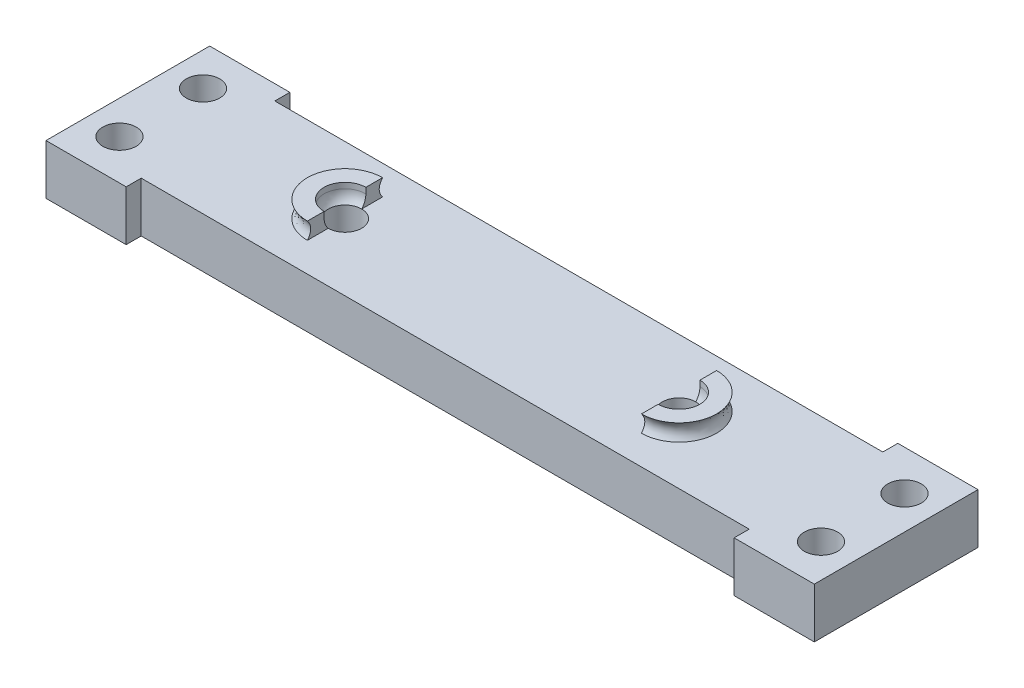
ISO-10303-21;
HEADER;
FILE_DESCRIPTION(('STEP AP214'),'2;1');
FILE_NAME('part.step','',(''),(''),'','','');
FILE_SCHEMA(('AUTOMOTIVE_DESIGN { 1 0 10303 214 1 1 1 1 }'));
ENDSEC;
DATA;
#1=APPLICATION_CONTEXT('core data for automotive mechanical design processes');
#2=APPLICATION_PROTOCOL_DEFINITION('international standard','automotive_design',2000,#1);
#3=PRODUCT_CONTEXT('',#1,'mechanical');
#4=PRODUCT('Part','Part','',(#3));
#5=PRODUCT_RELATED_PRODUCT_CATEGORY('part','',(#4));
#6=PRODUCT_DEFINITION_FORMATION('','',#4);
#7=PRODUCT_DEFINITION_CONTEXT('part definition',#1,'design');
#8=PRODUCT_DEFINITION('design','',#6,#7);
#9=PRODUCT_DEFINITION_SHAPE('','',#8);
#10=(LENGTH_UNIT() NAMED_UNIT(*) SI_UNIT(.MILLI.,.METRE.));
#11=(NAMED_UNIT(*) PLANE_ANGLE_UNIT() SI_UNIT($,.RADIAN.));
#12=(NAMED_UNIT(*) SI_UNIT($,.STERADIAN.) SOLID_ANGLE_UNIT());
#13=UNCERTAINTY_MEASURE_WITH_UNIT(LENGTH_MEASURE(1.E-05),#10,'distance_accuracy_value','');
#14=(GEOMETRIC_REPRESENTATION_CONTEXT(3) GLOBAL_UNCERTAINTY_ASSIGNED_CONTEXT((#13)) GLOBAL_UNIT_ASSIGNED_CONTEXT((#10,
#11,#12)) REPRESENTATION_CONTEXT('',''));
#15=CARTESIAN_POINT('',(0.,0.,0.));
#16=DIRECTION('',(0.,0.,1.));
#17=DIRECTION('',(1.,0.,0.));
#18=AXIS2_PLACEMENT_3D('',#15,#16,#17);
#19=CARTESIAN_POINT('',(3.00570826429431,5.,1.75));
#20=DIRECTION('',(1.,0.,0.));
#21=DIRECTION('',(0.,0.,-1.));
#22=AXIS2_PLACEMENT_3D('',#19,#20,#21);
#23=PLANE('',#22);
#24=CARTESIAN_POINT('',(3.00570826429431,4.,1.75));
#25=CARTESIAN_POINT('',(3.00570826429431,4.5,2.15));
#26=CARTESIAN_POINT('',(3.00570826429431,5.,1.75));
#27=B_SPLINE_CURVE_WITH_KNOTS('',2,(#24,#25,#26),.UNSPECIFIED.,.F.,.F.,(3,3),(0.,1.),.UNSPECIFIED.);
#28=CARTESIAN_POINT('',(3.00570826429431,4.,1.75));
#29=VERTEX_POINT('',#28);
#30=CARTESIAN_POINT('',(3.00570826429431,5.,1.75));
#31=VERTEX_POINT('',#30);
#32=EDGE_CURVE('E314',#29,#31,#27,.T.);
#33=ORIENTED_EDGE('',*,*,#32,.F.);
#34=DIRECTION('',(0.,0.,1.));
#35=VECTOR('',#34,1.);
#36=CARTESIAN_POINT('',(3.00570826429431,4.,1.75));
#37=LINE('',#36,#35);
#38=CARTESIAN_POINT('',(3.00570826429431,4.,3.00000000000001));
#39=VERTEX_POINT('',#38);
#40=EDGE_CURVE('E49',#29,#39,#37,.T.);
#41=ORIENTED_EDGE('',*,*,#40,.T.);
#42=CARTESIAN_POINT('',(3.00570826429431,4.66143782776615,3.75));
#43=DIRECTION('',(1.,0.,0.));
#44=DIRECTION('',(0.,0.,-1.));
#45=AXIS2_PLACEMENT_3D('',#42,#43,#44);
#46=CIRCLE('',#45,1.);
#47=CARTESIAN_POINT('',(3.00570826429431,4.66143782776615,2.75));
#48=VERTEX_POINT('',#47);
#49=EDGE_CURVE('E11',#39,#48,#46,.T.);
#50=ORIENTED_EDGE('',*,*,#49,.T.);
#51=DIRECTION('',(0.,-1.,0.));
#52=VECTOR('',#51,1.);
#53=CARTESIAN_POINT('',(3.00570826429431,5.,2.75));
#54=LINE('',#53,#52);
#55=CARTESIAN_POINT('',(3.00570826429431,5.,2.75));
#56=VERTEX_POINT('',#55);
#57=EDGE_CURVE('E353',#56,#48,#54,.T.);
#58=ORIENTED_EDGE('',*,*,#57,.F.);
#59=DIRECTION('',(0.,0.,1.));
#60=VECTOR('',#59,1.);
#61=CARTESIAN_POINT('',(3.00570826429431,5.,1.75));
#62=LINE('',#61,#60);
#63=EDGE_CURVE('E340',#31,#56,#62,.T.);
#64=ORIENTED_EDGE('',*,*,#63,.F.);
#65=EDGE_LOOP('',(#33,#41,#50,#58,#64));
#66=FACE_BOUND('',#65,.T.);
#67=ADVANCED_FACE('F35',(#66),#23,.F.);
#68=CARTESIAN_POINT('',(3.00570826429431,5.,5.25));
#69=DIRECTION('',(1.,0.,0.));
#70=DIRECTION('',(0.,0.,-1.));
#71=AXIS2_PLACEMENT_3D('',#68,#69,#70);
#72=PLANE('',#71);
#73=CARTESIAN_POINT('',(3.00570826429431,4.,6.25000000000001));
#74=CARTESIAN_POINT('',(3.00570826429431,4.5,5.85000000000001));
#75=CARTESIAN_POINT('',(3.00570826429431,5.,6.25000000000001));
#76=B_SPLINE_CURVE_WITH_KNOTS('',2,(#73,#74,#75),.UNSPECIFIED.,.F.,.F.,(3,3),(0.,1.),.UNSPECIFIED.);
#77=CARTESIAN_POINT('',(3.00570826429431,5.,6.25000000000001));
#78=VERTEX_POINT('',#77);
#79=CARTESIAN_POINT('',(3.00570826429431,4.,6.25000000000001));
#80=VERTEX_POINT('',#79);
#81=EDGE_CURVE('E284',#78,#80,#76,.F.);
#82=ORIENTED_EDGE('',*,*,#81,.F.);
#83=DIRECTION('',(0.,0.,1.));
#84=VECTOR('',#83,1.);
#85=CARTESIAN_POINT('',(3.00570826429431,5.,5.25));
#86=LINE('',#85,#84);
#87=CARTESIAN_POINT('',(3.00570826429431,5.,5.25000000000001));
#88=VERTEX_POINT('',#87);
#89=EDGE_CURVE('E344',#88,#78,#86,.T.);
#90=ORIENTED_EDGE('',*,*,#89,.F.);
#91=DIRECTION('',(0.,-1.,0.));
#92=VECTOR('',#91,1.);
#93=CARTESIAN_POINT('',(3.00570826429431,5.,5.25000000000001));
#94=LINE('',#93,#92);
#95=CARTESIAN_POINT('',(3.00570826429431,4.66143782776615,5.25000000000001));
#96=VERTEX_POINT('',#95);
#97=EDGE_CURVE('E347',#88,#96,#94,.T.);
#98=ORIENTED_EDGE('',*,*,#97,.T.);
#99=CARTESIAN_POINT('',(3.00570826429431,4.66143782776615,4.25000000000001));
#100=DIRECTION('',(1.,0.,0.));
#101=DIRECTION('',(0.,0.,-1.));
#102=AXIS2_PLACEMENT_3D('',#99,#100,#101);
#103=CIRCLE('',#102,1.);
#104=CARTESIAN_POINT('',(3.00570826429431,4.,5.00000000000001));
#105=VERTEX_POINT('',#104);
#106=EDGE_CURVE('E43',#96,#105,#103,.T.);
#107=ORIENTED_EDGE('',*,*,#106,.T.);
#108=DIRECTION('',(0.,0.,1.));
#109=VECTOR('',#108,1.);
#110=CARTESIAN_POINT('',(3.00570826429431,4.,5.25));
#111=LINE('',#110,#109);
#112=EDGE_CURVE('E56',#105,#80,#111,.T.);
#113=ORIENTED_EDGE('',*,*,#112,.T.);
#114=EDGE_LOOP('',(#82,#90,#98,#107,#113));
#115=FACE_BOUND('',#114,.T.);
#116=ADVANCED_FACE('F422',(#115),#72,.F.);
#117=CARTESIAN_POINT('',(0.,4.,0.));
#118=DIRECTION('',(0.,1.,0.));
#119=DIRECTION('',(0.,0.,1.));
#120=AXIS2_PLACEMENT_3D('',#117,#118,#119);
#121=PLANE('',#120);
#122=DIRECTION('',(0.,0.,-1.));
#123=VECTOR('',#122,1.);
#124=CARTESIAN_POINT('',(-16.9942917357057,4.,1.75000000000001));
#125=LINE('',#124,#123);
#126=CARTESIAN_POINT('',(-16.9942917357057,4.,3.));
#127=VERTEX_POINT('',#126);
#128=CARTESIAN_POINT('',(-16.9942917357057,4.,1.75000000000001));
#129=VERTEX_POINT('',#128);
#130=EDGE_CURVE('E361',#127,#129,#125,.T.);
#131=ORIENTED_EDGE('',*,*,#130,.F.);
#132=CARTESIAN_POINT('',(-16.9942917357057,4.,4.00000000000001));
#133=DIRECTION('',(0.,1.,0.));
#134=DIRECTION('',(0.,0.,1.));
#135=AXIS2_PLACEMENT_3D('',#132,#133,#134);
#136=CIRCLE('',#135,1.);
#137=CARTESIAN_POINT('',(-16.9942917357057,4.,5.00000000000001));
#138=VERTEX_POINT('',#137);
#139=EDGE_CURVE('E246',#138,#127,#136,.T.);
#140=ORIENTED_EDGE('',*,*,#139,.F.);
#141=DIRECTION('',(0.,0.,-1.));
#142=VECTOR('',#141,1.);
#143=CARTESIAN_POINT('',(-16.9942917357057,4.,6.25000000000001));
#144=LINE('',#143,#142);
#145=CARTESIAN_POINT('',(-16.9942917357057,4.,6.25000000000001));
#146=VERTEX_POINT('',#145);
#147=EDGE_CURVE('E370',#146,#138,#144,.T.);
#148=ORIENTED_EDGE('',*,*,#147,.F.);
#149=CARTESIAN_POINT('',(-16.9942917357057,4.,4.00000000000001));
#150=DIRECTION('',(0.,1.,0.));
#151=DIRECTION('',(0.,0.,1.));
#152=AXIS2_PLACEMENT_3D('',#149,#150,#151);
#153=CIRCLE('',#152,2.25);
#154=EDGE_CURVE('E356',#129,#146,#153,.T.);
#155=ORIENTED_EDGE('',*,*,#154,.F.);
#156=EDGE_LOOP('',(#131,#140,#148,#155));
#157=FACE_BOUND('',#156,.T.);
#158=ORIENTED_EDGE('',*,*,#112,.F.);
#159=CARTESIAN_POINT('',(3.00570826429431,4.,4.00000000000001));
#160=DIRECTION('',(0.,1.,0.));
#161=DIRECTION('',(0.,0.,1.));
#162=AXIS2_PLACEMENT_3D('',#159,#160,#161);
#163=CIRCLE('',#162,1.);
#164=EDGE_CURVE('E249',#39,#105,#163,.T.);
#165=ORIENTED_EDGE('',*,*,#164,.F.);
#166=ORIENTED_EDGE('',*,*,#40,.F.);
#167=CARTESIAN_POINT('',(3.00570826429431,4.,4.00000000000001));
#168=DIRECTION('',(0.,1.,0.));
#169=DIRECTION('',(0.,0.,-1.));
#170=AXIS2_PLACEMENT_3D('',#167,#168,#169);
#171=CIRCLE('',#170,2.25);
#172=EDGE_CURVE('E333',#80,#29,#171,.T.);
#173=ORIENTED_EDGE('',*,*,#172,.F.);
#174=EDGE_LOOP('',(#158,#165,#166,#173));
#175=FACE_BOUND('',#174,.T.);
#176=DIRECTION('',(1.,0.,0.));
#177=VECTOR('',#176,1.);
#178=CARTESIAN_POINT('',(0.,4.,-0.899999999999998));
#179=LINE('',#178,#177);
#180=CARTESIAN_POINT('',(-29.9942917357057,4.,-0.900000000000001));
#181=VERTEX_POINT('',#180);
#182=CARTESIAN_POINT('',(-25.1942917357057,4.,-0.900000000000001));
#183=VERTEX_POINT('',#182);
#184=EDGE_CURVE('E194',#181,#183,#179,.T.);
#185=ORIENTED_EDGE('',*,*,#184,.F.);
#186=DIRECTION('',(0.,0.,1.));
#187=VECTOR('',#186,1.);
#188=CARTESIAN_POINT('',(-29.9942917357057,4.,-0.999999999999999));
#189=LINE('',#188,#187);
#190=CARTESIAN_POINT('',(-29.9942917357057,4.,8.90000000000001));
#191=VERTEX_POINT('',#190);
#192=EDGE_CURVE('E191',#181,#191,#189,.T.);
#193=ORIENTED_EDGE('',*,*,#192,.T.);
#194=DIRECTION('',(-1.,0.,0.));
#195=VECTOR('',#194,1.);
#196=CARTESIAN_POINT('',(0.,4.,8.90000000000001));
#197=LINE('',#196,#195);
#198=CARTESIAN_POINT('',(-25.1942917357057,4.,8.90000000000001));
#199=VERTEX_POINT('',#198);
#200=EDGE_CURVE('E255',#199,#191,#197,.T.);
#201=ORIENTED_EDGE('',*,*,#200,.F.);
#202=DIRECTION('',(0.,0.,1.));
#203=VECTOR('',#202,1.);
#204=CARTESIAN_POINT('',(-25.1942917357057,4.,0.));
#205=LINE('',#204,#203);
#206=CARTESIAN_POINT('',(-25.1942917357057,4.,8.00000000000001));
#207=VERTEX_POINT('',#206);
#208=EDGE_CURVE('E281',#207,#199,#205,.T.);
#209=ORIENTED_EDGE('',*,*,#208,.F.);
#210=DIRECTION('',(1.,0.,0.));
#211=VECTOR('',#210,1.);
#212=CARTESIAN_POINT('',(11.0057082642943,4.,8.));
#213=LINE('',#212,#211);
#214=CARTESIAN_POINT('',(11.2057082642943,4.,8.));
#215=VERTEX_POINT('',#214);
#216=EDGE_CURVE('E392',#207,#215,#213,.T.);
#217=ORIENTED_EDGE('',*,*,#216,.T.);
#218=DIRECTION('',(0.,0.,-1.));
#219=VECTOR('',#218,1.);
#220=CARTESIAN_POINT('',(11.2057082642943,4.,0.));
#221=LINE('',#220,#219);
#222=CARTESIAN_POINT('',(11.2057082642943,4.,8.9));
#223=VERTEX_POINT('',#222);
#224=EDGE_CURVE('E273',#223,#215,#221,.T.);
#225=ORIENTED_EDGE('',*,*,#224,.F.);
#226=DIRECTION('',(-1.,0.,0.));
#227=VECTOR('',#226,1.);
#228=CARTESIAN_POINT('',(0.,4.,8.9));
#229=LINE('',#228,#227);
#230=CARTESIAN_POINT('',(16.0057082642943,4.,8.9));
#231=VERTEX_POINT('',#230);
#232=EDGE_CURVE('E264',#231,#223,#229,.T.);
#233=ORIENTED_EDGE('',*,*,#232,.F.);
#234=DIRECTION('',(0.,0.,-1.));
#235=VECTOR('',#234,1.);
#236=CARTESIAN_POINT('',(16.0057082642943,4.,9.));
#237=LINE('',#236,#235);
#238=CARTESIAN_POINT('',(16.0057082642943,4.,-0.900000000000004));
#239=VERTEX_POINT('',#238);
#240=EDGE_CURVE('E395',#231,#239,#237,.T.);
#241=ORIENTED_EDGE('',*,*,#240,.T.);
#242=DIRECTION('',(1.,0.,0.));
#243=VECTOR('',#242,1.);
#244=CARTESIAN_POINT('',(0.,4.,-0.900000000000004));
#245=LINE('',#244,#243);
#246=CARTESIAN_POINT('',(11.2057082642943,4.,-0.900000000000004));
#247=VERTEX_POINT('',#246);
#248=EDGE_CURVE('E260',#247,#239,#245,.T.);
#249=ORIENTED_EDGE('',*,*,#248,.F.);
#250=DIRECTION('',(0.,0.,-1.));
#251=VECTOR('',#250,1.);
#252=CARTESIAN_POINT('',(11.2057082642943,4.,0.));
#253=LINE('',#252,#251);
#254=CARTESIAN_POINT('',(11.2057082642943,4.,0.));
#255=VERTEX_POINT('',#254);
#256=EDGE_CURVE('E268',#255,#247,#253,.T.);
#257=ORIENTED_EDGE('',*,*,#256,.F.);
#258=DIRECTION('',(-1.,0.,0.));
#259=VECTOR('',#258,1.);
#260=CARTESIAN_POINT('',(-24.9942917357057,4.,0.));
#261=LINE('',#260,#259);
#262=CARTESIAN_POINT('',(-25.1942917357057,4.,0.));
#263=VERTEX_POINT('',#262);
#264=EDGE_CURVE('E398',#255,#263,#261,.T.);
#265=ORIENTED_EDGE('',*,*,#264,.T.);
#266=DIRECTION('',(0.,0.,1.));
#267=VECTOR('',#266,1.);
#268=CARTESIAN_POINT('',(-25.1942917357057,4.,0.));
#269=LINE('',#268,#267);
#270=EDGE_CURVE('E277',#183,#263,#269,.T.);
#271=ORIENTED_EDGE('',*,*,#270,.F.);
#272=EDGE_LOOP('',(#185,#193,#201,#209,#217,#225,#233,#241,#249,#257,#265,#271));
#273=FACE_BOUND('',#272,.T.);
#274=CARTESIAN_POINT('',(14.0057082642943,4.,6.5));
#275=DIRECTION('',(0.,1.,0.));
#276=DIRECTION('',(0.,0.,1.));
#277=AXIS2_PLACEMENT_3D('',#274,#275,#276);
#278=CIRCLE('',#277,1.);
#279=CARTESIAN_POINT('',(14.0057082642943,4.,7.50000000000001));
#280=VERTEX_POINT('',#279);
#281=EDGE_CURVE('E379',#280,#280,#278,.T.);
#282=ORIENTED_EDGE('',*,*,#281,.F.);
#283=EDGE_LOOP('',(#282));
#284=FACE_BOUND('',#283,.T.);
#285=CARTESIAN_POINT('',(-27.9942917357057,4.,1.5));
#286=DIRECTION('',(0.,1.,0.));
#287=DIRECTION('',(0.,0.,1.));
#288=AXIS2_PLACEMENT_3D('',#285,#286,#287);
#289=CIRCLE('',#288,1.);
#290=CARTESIAN_POINT('',(-27.9942917357057,4.,2.5));
#291=VERTEX_POINT('',#290);
#292=EDGE_CURVE('E385',#291,#291,#289,.T.);
#293=ORIENTED_EDGE('',*,*,#292,.F.);
#294=EDGE_LOOP('',(#293));
#295=FACE_BOUND('',#294,.T.);
#296=CARTESIAN_POINT('',(-27.9942917357057,4.,6.5));
#297=DIRECTION('',(0.,1.,0.));
#298=DIRECTION('',(0.,0.,1.));
#299=AXIS2_PLACEMENT_3D('',#296,#297,#298);
#300=CIRCLE('',#299,1.);
#301=CARTESIAN_POINT('',(-27.9942917357057,4.,7.50000000000001));
#302=VERTEX_POINT('',#301);
#303=EDGE_CURVE('E388',#302,#302,#300,.T.);
#304=ORIENTED_EDGE('',*,*,#303,.F.);
#305=EDGE_LOOP('',(#304));
#306=FACE_BOUND('',#305,.T.);
#307=CARTESIAN_POINT('',(14.0057082642943,4.,1.5));
#308=DIRECTION('',(0.,1.,0.));
#309=DIRECTION('',(0.,0.,1.));
#310=AXIS2_PLACEMENT_3D('',#307,#308,#309);
#311=CIRCLE('',#310,1.);
#312=CARTESIAN_POINT('',(14.0057082642943,4.,2.5));
#313=VERTEX_POINT('',#312);
#314=EDGE_CURVE('E382',#313,#313,#311,.T.);
#315=ORIENTED_EDGE('',*,*,#314,.F.);
#316=EDGE_LOOP('',(#315));
#317=FACE_BOUND('',#316,.T.);
#318=ADVANCED_FACE('F438',(#157,#175,#273,#284,#295,#306,#317),#121,.T.);
#319=CARTESIAN_POINT('',(-29.9942917357057,4.,-0.999999999999999));
#320=DIRECTION('',(1.,0.,0.));
#321=DIRECTION('',(0.,0.,-1.));
#322=AXIS2_PLACEMENT_3D('',#319,#320,#321);
#323=PLANE('',#322);
#324=ORIENTED_EDGE('',*,*,#192,.F.);
#325=DIRECTION('',(0.,-1.,0.));
#326=VECTOR('',#325,1.);
#327=CARTESIAN_POINT('',(-29.9942917357057,7.,-0.900000000000001));
#328=LINE('',#327,#326);
#329=CARTESIAN_POINT('',(-29.9942917357057,1.,-0.900000000000001));
#330=VERTEX_POINT('',#329);
#331=EDGE_CURVE('E185',#181,#330,#328,.T.);
#332=ORIENTED_EDGE('',*,*,#331,.T.);
#333=DIRECTION('',(0.,0.,-1.));
#334=VECTOR('',#333,1.);
#335=CARTESIAN_POINT('',(-29.9942917357057,1.,-0.900000000000001));
#336=LINE('',#335,#334);
#337=CARTESIAN_POINT('',(-29.9942917357057,1.,8.90000000000001));
#338=VERTEX_POINT('',#337);
#339=EDGE_CURVE('E190',#338,#330,#336,.T.);
#340=ORIENTED_EDGE('',*,*,#339,.F.);
#341=DIRECTION('',(0.,-1.,0.));
#342=VECTOR('',#341,1.);
#343=CARTESIAN_POINT('',(-29.9942917357057,7.,8.90000000000001));
#344=LINE('',#343,#342);
#345=EDGE_CURVE('E253',#191,#338,#344,.T.);
#346=ORIENTED_EDGE('',*,*,#345,.F.);
#347=EDGE_LOOP('',(#324,#332,#340,#346));
#348=FACE_BOUND('',#347,.T.);
#349=ADVANCED_FACE('F187',(#348),#323,.F.);
#350=CARTESIAN_POINT('',(11.0057082642943,4.,8.));
#351=DIRECTION('',(0.,0.,-1.));
#352=DIRECTION('',(-1.,0.,0.));
#353=AXIS2_PLACEMENT_3D('',#350,#351,#352);
#354=PLANE('',#353);
#355=DIRECTION('',(0.,-1.,0.));
#356=VECTOR('',#355,1.);
#357=CARTESIAN_POINT('',(-25.1942917357057,7.,8.00000000000001));
#358=LINE('',#357,#356);
#359=CARTESIAN_POINT('',(-25.1942917357057,1.,8.00000000000001));
#360=VERTEX_POINT('',#359);
#361=EDGE_CURVE('E279',#207,#360,#358,.T.);
#362=ORIENTED_EDGE('',*,*,#361,.T.);
#363=DIRECTION('',(-1.,0.,0.));
#364=VECTOR('',#363,1.);
#365=CARTESIAN_POINT('',(-25.1942917357057,1.,8.00000000000001));
#366=LINE('',#365,#364);
#367=CARTESIAN_POINT('',(11.2057082642943,1.,8.));
#368=VERTEX_POINT('',#367);
#369=EDGE_CURVE('E239',#368,#360,#366,.T.);
#370=ORIENTED_EDGE('',*,*,#369,.F.);
#371=DIRECTION('',(0.,-1.,0.));
#372=VECTOR('',#371,1.);
#373=CARTESIAN_POINT('',(11.2057082642943,7.,8.));
#374=LINE('',#373,#372);
#375=EDGE_CURVE('E271',#215,#368,#374,.T.);
#376=ORIENTED_EDGE('',*,*,#375,.F.);
#377=ORIENTED_EDGE('',*,*,#216,.F.);
#378=EDGE_LOOP('',(#362,#370,#376,#377));
#379=FACE_BOUND('',#378,.T.);
#380=ADVANCED_FACE('F533',(#379),#354,.F.);
#381=CARTESIAN_POINT('',(16.0057082642943,4.,9.));
#382=DIRECTION('',(-1.,0.,0.));
#383=DIRECTION('',(0.,0.,1.));
#384=AXIS2_PLACEMENT_3D('',#381,#382,#383);
#385=PLANE('',#384);
#386=DIRECTION('',(0.,-1.,0.));
#387=VECTOR('',#386,1.);
#388=CARTESIAN_POINT('',(16.0057082642943,7.,8.9));
#389=LINE('',#388,#387);
#390=CARTESIAN_POINT('',(16.0057082642943,1.,8.9));
#391=VERTEX_POINT('',#390);
#392=EDGE_CURVE('E262',#231,#391,#389,.T.);
#393=ORIENTED_EDGE('',*,*,#392,.T.);
#394=DIRECTION('',(0.,0.,1.));
#395=VECTOR('',#394,1.);
#396=CARTESIAN_POINT('',(16.0057082642943,1.,8.9));
#397=LINE('',#396,#395);
#398=CARTESIAN_POINT('',(16.0057082642943,1.,-0.900000000000004));
#399=VERTEX_POINT('',#398);
#400=EDGE_CURVE('E230',#399,#391,#397,.T.);
#401=ORIENTED_EDGE('',*,*,#400,.F.);
#402=DIRECTION('',(0.,-1.,0.));
#403=VECTOR('',#402,1.);
#404=CARTESIAN_POINT('',(16.0057082642943,7.,-0.900000000000004));
#405=LINE('',#404,#403);
#406=EDGE_CURVE('E258',#239,#399,#405,.T.);
#407=ORIENTED_EDGE('',*,*,#406,.F.);
#408=ORIENTED_EDGE('',*,*,#240,.F.);
#409=EDGE_LOOP('',(#393,#401,#407,#408));
#410=FACE_BOUND('',#409,.T.);
#411=ADVANCED_FACE('F529',(#410),#385,.F.);
#412=CARTESIAN_POINT('',(-24.9942917357057,4.,0.));
#413=DIRECTION('',(0.,0.,1.));
#414=DIRECTION('',(1.,0.,0.));
#415=AXIS2_PLACEMENT_3D('',#412,#413,#414);
#416=PLANE('',#415);
#417=DIRECTION('',(0.,-1.,0.));
#418=VECTOR('',#417,1.);
#419=CARTESIAN_POINT('',(11.2057082642943,7.,0.));
#420=LINE('',#419,#418);
#421=CARTESIAN_POINT('',(11.2057082642943,1.,0.));
#422=VERTEX_POINT('',#421);
#423=EDGE_CURVE('E266',#255,#422,#420,.T.);
#424=ORIENTED_EDGE('',*,*,#423,.T.);
#425=DIRECTION('',(1.,0.,0.));
#426=VECTOR('',#425,1.);
#427=CARTESIAN_POINT('',(11.2057082642943,1.,0.));
#428=LINE('',#427,#426);
#429=CARTESIAN_POINT('',(-25.1942917357057,1.,0.));
#430=VERTEX_POINT('',#429);
#431=EDGE_CURVE('E221',#430,#422,#428,.T.);
#432=ORIENTED_EDGE('',*,*,#431,.F.);
#433=DIRECTION('',(0.,-1.,0.));
#434=VECTOR('',#433,1.);
#435=CARTESIAN_POINT('',(-25.1942917357057,7.,0.));
#436=LINE('',#435,#434);
#437=EDGE_CURVE('E275',#263,#430,#436,.T.);
#438=ORIENTED_EDGE('',*,*,#437,.F.);
#439=ORIENTED_EDGE('',*,*,#264,.F.);
#440=EDGE_LOOP('',(#424,#432,#438,#439));
#441=FACE_BOUND('',#440,.T.);
#442=ADVANCED_FACE('F524',(#441),#416,.F.);
#443=CARTESIAN_POINT('',(-27.9942917357057,4.,6.5));
#444=DIRECTION('',(0.,-1.,0.));
#445=DIRECTION('',(0.,0.,-1.));
#446=AXIS2_PLACEMENT_3D('',#443,#444,#445);
#447=CYLINDRICAL_SURFACE('',#446,1.);
#448=ORIENTED_EDGE('',*,*,#303,.T.);
#449=EDGE_LOOP('',(#448));
#450=FACE_BOUND('',#449,.T.);
#451=CARTESIAN_POINT('',(-27.9942917357057,1.,6.5));
#452=DIRECTION('',(0.,-1.,0.));
#453=DIRECTION('',(0.,0.,-1.));
#454=AXIS2_PLACEMENT_3D('',#451,#452,#453);
#455=CIRCLE('',#454,1.);
#456=CARTESIAN_POINT('',(-27.9942917357057,1.,5.5));
#457=VERTEX_POINT('',#456);
#458=EDGE_CURVE('E213',#457,#457,#455,.T.);
#459=ORIENTED_EDGE('',*,*,#458,.T.);
#460=EDGE_LOOP('',(#459));
#461=FACE_BOUND('',#460,.T.);
#462=ADVANCED_FACE('F521',(#450,#461),#447,.F.);
#463=CARTESIAN_POINT('',(-27.9942917357057,4.,1.5));
#464=DIRECTION('',(0.,-1.,0.));
#465=DIRECTION('',(0.,0.,-1.));
#466=AXIS2_PLACEMENT_3D('',#463,#464,#465);
#467=CYLINDRICAL_SURFACE('',#466,1.);
#468=ORIENTED_EDGE('',*,*,#292,.T.);
#469=EDGE_LOOP('',(#468));
#470=FACE_BOUND('',#469,.T.);
#471=CARTESIAN_POINT('',(-27.9942917357057,1.,1.5));
#472=DIRECTION('',(0.,-1.,0.));
#473=DIRECTION('',(0.,0.,-1.));
#474=AXIS2_PLACEMENT_3D('',#471,#472,#473);
#475=CIRCLE('',#474,1.);
#476=CARTESIAN_POINT('',(-27.9942917357057,1.,0.500000000000002));
#477=VERTEX_POINT('',#476);
#478=EDGE_CURVE('E216',#477,#477,#475,.T.);
#479=ORIENTED_EDGE('',*,*,#478,.T.);
#480=EDGE_LOOP('',(#479));
#481=FACE_BOUND('',#480,.T.);
#482=ADVANCED_FACE('F457',(#470,#481),#467,.F.);
#483=CARTESIAN_POINT('',(14.0057082642943,4.,1.5));
#484=DIRECTION('',(0.,-1.,0.));
#485=DIRECTION('',(0.,0.,-1.));
#486=AXIS2_PLACEMENT_3D('',#483,#484,#485);
#487=CYLINDRICAL_SURFACE('',#486,1.);
#488=ORIENTED_EDGE('',*,*,#314,.T.);
#489=EDGE_LOOP('',(#488));
#490=FACE_BOUND('',#489,.T.);
#491=CARTESIAN_POINT('',(14.0057082642943,1.,1.5));
#492=DIRECTION('',(0.,-1.,0.));
#493=DIRECTION('',(0.,0.,-1.));
#494=AXIS2_PLACEMENT_3D('',#491,#492,#493);
#495=CIRCLE('',#494,1.);
#496=CARTESIAN_POINT('',(14.0057082642943,1.,0.500000000000002));
#497=VERTEX_POINT('',#496);
#498=EDGE_CURVE('E461',#497,#497,#495,.T.);
#499=ORIENTED_EDGE('',*,*,#498,.T.);
#500=EDGE_LOOP('',(#499));
#501=FACE_BOUND('',#500,.T.);
#502=ADVANCED_FACE('F453',(#490,#501),#487,.F.);
#503=CARTESIAN_POINT('',(14.0057082642943,4.,6.5));
#504=DIRECTION('',(0.,-1.,0.));
#505=DIRECTION('',(0.,0.,-1.));
#506=AXIS2_PLACEMENT_3D('',#503,#504,#505);
#507=CYLINDRICAL_SURFACE('',#506,1.);
#508=ORIENTED_EDGE('',*,*,#281,.T.);
#509=EDGE_LOOP('',(#508));
#510=FACE_BOUND('',#509,.T.);
#511=CARTESIAN_POINT('',(14.0057082642943,1.,6.5));
#512=DIRECTION('',(0.,-1.,0.));
#513=DIRECTION('',(0.,0.,-1.));
#514=AXIS2_PLACEMENT_3D('',#511,#512,#513);
#515=CIRCLE('',#514,1.);
#516=CARTESIAN_POINT('',(14.0057082642943,1.,5.5));
#517=VERTEX_POINT('',#516);
#518=EDGE_CURVE('E463',#517,#517,#515,.T.);
#519=ORIENTED_EDGE('',*,*,#518,.T.);
#520=EDGE_LOOP('',(#519));
#521=FACE_BOUND('',#520,.T.);
#522=ADVANCED_FACE('F456',(#510,#521),#507,.F.);
#523=CARTESIAN_POINT('',(-16.9942917357057,5.,6.25000000000001));
#524=DIRECTION('',(-1.,0.,0.));
#525=DIRECTION('',(0.,0.,1.));
#526=AXIS2_PLACEMENT_3D('',#523,#524,#525);
#527=PLANE('',#526);
#528=DIRECTION('',(0.,0.,-1.));
#529=VECTOR('',#528,1.);
#530=CARTESIAN_POINT('',(-16.9942917357057,5.,6.25000000000001));
#531=LINE('',#530,#529);
#532=CARTESIAN_POINT('',(-16.9942917357057,5.,6.25000000000001));
#533=VERTEX_POINT('',#532);
#534=CARTESIAN_POINT('',(-16.9942917357057,5.,5.25000000000001));
#535=VERTEX_POINT('',#534);
#536=EDGE_CURVE('E360',#533,#535,#531,.T.);
#537=ORIENTED_EDGE('',*,*,#536,.F.);
#538=CARTESIAN_POINT('',(-16.9942917357057,5.,6.25));
#539=CARTESIAN_POINT('',(-16.9942917357057,4.5,5.85));
#540=CARTESIAN_POINT('',(-16.9942917357057,4.,6.25));
#541=B_SPLINE_CURVE_WITH_KNOTS('',2,(#538,#539,#540),.UNSPECIFIED.,.F.,.F.,(3,3),(0.,1.),.UNSPECIFIED.);
#542=EDGE_CURVE('E325',#533,#146,#541,.T.);
#543=ORIENTED_EDGE('',*,*,#542,.T.);
#544=ORIENTED_EDGE('',*,*,#147,.T.);
#545=CARTESIAN_POINT('',(-16.9942917357057,4.66143782776615,4.25000000000001));
#546=DIRECTION('',(-1.,0.,0.));
#547=DIRECTION('',(0.,0.,1.));
#548=AXIS2_PLACEMENT_3D('',#545,#546,#547);
#549=CIRCLE('',#548,1.);
#550=CARTESIAN_POINT('',(-16.9942917357057,4.66143782776615,5.25000000000001));
#551=VERTEX_POINT('',#550);
#552=EDGE_CURVE('E415',#138,#551,#549,.T.);
#553=ORIENTED_EDGE('',*,*,#552,.T.);
#554=DIRECTION('',(0.,-1.,0.));
#555=VECTOR('',#554,1.);
#556=CARTESIAN_POINT('',(-16.9942917357057,5.,5.25000000000001));
#557=LINE('',#556,#555);
#558=EDGE_CURVE('E376',#535,#551,#557,.T.);
#559=ORIENTED_EDGE('',*,*,#558,.F.);
#560=EDGE_LOOP('',(#537,#543,#544,#553,#559));
#561=FACE_BOUND('',#560,.T.);
#562=ADVANCED_FACE('F511',(#561),#527,.F.);
#563=CARTESIAN_POINT('',(-16.9942917357057,5.,4.00000000000001));
#564=DIRECTION('',(0.,-1.,0.));
#565=DIRECTION('',(0.,0.,-1.));
#566=AXIS2_PLACEMENT_3D('',#563,#564,#565);
#567=CYLINDRICAL_SURFACE('',#566,1.25);
#568=ORIENTED_EDGE('',*,*,#558,.T.);
#569=CARTESIAN_POINT('',(-16.9942917357057,4.66143782776615,4.00000000000001));
#570=DIRECTION('',(0.,-1.,0.));
#571=DIRECTION('',(0.,0.,-1.));
#572=AXIS2_PLACEMENT_3D('',#569,#570,#571);
#573=CIRCLE('',#572,1.25);
#574=CARTESIAN_POINT('',(-16.9942917357057,4.66143782776615,2.75));
#575=VERTEX_POINT('',#574);
#576=EDGE_CURVE('E409',#551,#575,#573,.T.);
#577=ORIENTED_EDGE('',*,*,#576,.T.);
#578=DIRECTION('',(0.,-1.,0.));
#579=VECTOR('',#578,1.);
#580=CARTESIAN_POINT('',(-16.9942917357057,5.,2.75));
#581=LINE('',#580,#579);
#582=CARTESIAN_POINT('',(-16.9942917357057,5.,2.75));
#583=VERTEX_POINT('',#582);
#584=EDGE_CURVE('E368',#583,#575,#581,.T.);
#585=ORIENTED_EDGE('',*,*,#584,.F.);
#586=CARTESIAN_POINT('',(-16.9942917357057,5.,4.00000000000001));
#587=DIRECTION('',(0.,-1.,0.));
#588=DIRECTION('',(0.,0.,1.));
#589=AXIS2_PLACEMENT_3D('',#586,#587,#588);
#590=CIRCLE('',#589,1.25);
#591=EDGE_CURVE('E363',#535,#583,#590,.T.);
#592=ORIENTED_EDGE('',*,*,#591,.F.);
#593=EDGE_LOOP('',(#568,#577,#585,#592));
#594=FACE_BOUND('',#593,.T.);
#595=ADVANCED_FACE('F507',(#594),#567,.F.);
#596=CARTESIAN_POINT('',(-16.9942917357057,5.,1.75000000000001));
#597=DIRECTION('',(-1.,0.,0.));
#598=DIRECTION('',(0.,0.,1.));
#599=AXIS2_PLACEMENT_3D('',#596,#597,#598);
#600=PLANE('',#599);
#601=ORIENTED_EDGE('',*,*,#130,.T.);
#602=CARTESIAN_POINT('',(-16.9942917357057,5.,1.75000000000001));
#603=CARTESIAN_POINT('',(-16.9942917357057,4.5,2.15));
#604=CARTESIAN_POINT('',(-16.9942917357057,4.,1.75000000000001));
#605=B_SPLINE_CURVE_WITH_KNOTS('',2,(#602,#603,#604),.UNSPECIFIED.,.F.,.F.,(3,3),(0.,1.),.UNSPECIFIED.);
#606=CARTESIAN_POINT('',(-16.9942917357057,5.,1.75000000000001));
#607=VERTEX_POINT('',#606);
#608=EDGE_CURVE('E317',#129,#607,#605,.F.);
#609=ORIENTED_EDGE('',*,*,#608,.T.);
#610=DIRECTION('',(0.,0.,-1.));
#611=VECTOR('',#610,1.);
#612=CARTESIAN_POINT('',(-16.9942917357057,5.,1.75000000000001));
#613=LINE('',#612,#611);
#614=EDGE_CURVE('E365',#583,#607,#613,.T.);
#615=ORIENTED_EDGE('',*,*,#614,.F.);
#616=ORIENTED_EDGE('',*,*,#584,.T.);
#617=CARTESIAN_POINT('',(-16.9942917357057,4.66143782776615,3.75));
#618=DIRECTION('',(-1.,0.,0.));
#619=DIRECTION('',(0.,0.,1.));
#620=AXIS2_PLACEMENT_3D('',#617,#618,#619);
#621=CIRCLE('',#620,1.);
#622=EDGE_CURVE('E412',#575,#127,#621,.T.);
#623=ORIENTED_EDGE('',*,*,#622,.T.);
#624=EDGE_LOOP('',(#601,#609,#615,#616,#623));
#625=FACE_BOUND('',#624,.T.);
#626=ADVANCED_FACE('F503',(#625),#600,.F.);
#627=CARTESIAN_POINT('',(-16.9942917357057,5.,4.00000000000001));
#628=DIRECTION('',(0.,1.,0.));
#629=DIRECTION('',(0.,0.,1.));
#630=AXIS2_PLACEMENT_3D('',#627,#628,#629);
#631=PLANE('',#630);
#632=CARTESIAN_POINT('',(-16.9942917357057,5.,4.00000000000001));
#633=DIRECTION('',(0.,1.,0.));
#634=DIRECTION('',(0.,0.,1.));
#635=AXIS2_PLACEMENT_3D('',#632,#633,#634);
#636=CIRCLE('',#635,2.25);
#637=EDGE_CURVE('E357',#607,#533,#636,.T.);
#638=ORIENTED_EDGE('',*,*,#637,.T.);
#639=ORIENTED_EDGE('',*,*,#536,.T.);
#640=ORIENTED_EDGE('',*,*,#591,.T.);
#641=ORIENTED_EDGE('',*,*,#614,.T.);
#642=EDGE_LOOP('',(#638,#639,#640,#641));
#643=FACE_BOUND('',#642,.T.);
#644=ADVANCED_FACE('F500',(#643),#631,.T.);
#645=CARTESIAN_POINT('',(3.00570826429431,5.,4.00000000000001));
#646=DIRECTION('',(0.,-1.,0.));
#647=DIRECTION('',(0.,0.,-1.));
#648=AXIS2_PLACEMENT_3D('',#645,#646,#647);
#649=CYLINDRICAL_SURFACE('',#648,1.25);
#650=ORIENTED_EDGE('',*,*,#57,.T.);
#651=CARTESIAN_POINT('',(3.00570826429431,4.66143782776615,4.00000000000001));
#652=DIRECTION('',(0.,-1.,0.));
#653=DIRECTION('',(0.,0.,-1.));
#654=AXIS2_PLACEMENT_3D('',#651,#652,#653);
#655=CIRCLE('',#654,1.25);
#656=EDGE_CURVE('E417',#48,#96,#655,.T.);
#657=ORIENTED_EDGE('',*,*,#656,.T.);
#658=ORIENTED_EDGE('',*,*,#97,.F.);
#659=CARTESIAN_POINT('',(3.00570826429431,5.,4.00000000000001));
#660=DIRECTION('',(0.,-1.,0.));
#661=DIRECTION('',(0.,0.,-1.));
#662=AXIS2_PLACEMENT_3D('',#659,#660,#661);
#663=CIRCLE('',#662,1.25);
#664=EDGE_CURVE('E342',#56,#88,#663,.T.);
#665=ORIENTED_EDGE('',*,*,#664,.F.);
#666=EDGE_LOOP('',(#650,#657,#658,#665));
#667=FACE_BOUND('',#666,.T.);
#668=ADVANCED_FACE('F436',(#667),#649,.F.);
#669=CARTESIAN_POINT('',(3.00570826429431,5.,4.00000000000001));
#670=DIRECTION('',(0.,-1.,0.));
#671=DIRECTION('',(0.,0.,-1.));
#672=AXIS2_PLACEMENT_3D('',#669,#670,#671);
#673=PLANE('',#672);
#674=CARTESIAN_POINT('',(3.00570826429431,5.,4.00000000000001));
#675=DIRECTION('',(0.,1.,0.));
#676=DIRECTION('',(0.,0.,-1.));
#677=AXIS2_PLACEMENT_3D('',#674,#675,#676);
#678=CIRCLE('',#677,2.25);
#679=EDGE_CURVE('E334',#78,#31,#678,.T.);
#680=ORIENTED_EDGE('',*,*,#679,.T.);
#681=ORIENTED_EDGE('',*,*,#63,.T.);
#682=ORIENTED_EDGE('',*,*,#664,.T.);
#683=ORIENTED_EDGE('',*,*,#89,.T.);
#684=EDGE_LOOP('',(#680,#681,#682,#683));
#685=FACE_BOUND('',#684,.T.);
#686=ADVANCED_FACE('F307',(#685),#673,.F.);
#687=CARTESIAN_POINT('',(-16.9942917357057,5.,1.75000000000001));
#688=CARTESIAN_POINT('',(-16.9942917357057,4.5,2.15));
#689=CARTESIAN_POINT('',(-16.9942917357057,4.,1.75000000000001));
#690=B_SPLINE_CURVE_WITH_KNOTS('',2,(#687,#688,#689),.UNSPECIFIED.,.F.,.F.,(3,3),(0.,1.),.UNSPECIFIED.);
#691=CARTESIAN_POINT('',(-16.9942917357057,5.,4.00000000000001));
#692=DIRECTION('',(0.,-1.,0.));
#693=AXIS1_PLACEMENT('',#691,#692);
#694=SURFACE_OF_REVOLUTION('',#690,#693);
#695=ORIENTED_EDGE('',*,*,#637,.F.);
#696=ORIENTED_EDGE('',*,*,#608,.F.);
#697=ORIENTED_EDGE('',*,*,#154,.T.);
#698=ORIENTED_EDGE('',*,*,#542,.F.);
#699=EDGE_LOOP('',(#695,#696,#697,#698));
#700=FACE_BOUND('',#699,.T.);
#701=ADVANCED_FACE('F301',(#700),#694,.T.);
#702=CARTESIAN_POINT('',(3.00570826429431,4.,1.75));
#703=CARTESIAN_POINT('',(3.00570826429431,4.5,2.15));
#704=CARTESIAN_POINT('',(3.00570826429431,5.,1.75));
#705=B_SPLINE_CURVE_WITH_KNOTS('',2,(#702,#703,#704),.UNSPECIFIED.,.F.,.F.,(3,3),(0.,1.),.UNSPECIFIED.);
#706=CARTESIAN_POINT('',(3.00570826429431,5.,4.00000000000001));
#707=DIRECTION('',(0.,-1.,0.));
#708=AXIS1_PLACEMENT('',#706,#707);
#709=SURFACE_OF_REVOLUTION('',#705,#708);
#710=ORIENTED_EDGE('',*,*,#32,.T.);
#711=ORIENTED_EDGE('',*,*,#679,.F.);
#712=ORIENTED_EDGE('',*,*,#81,.T.);
#713=ORIENTED_EDGE('',*,*,#172,.T.);
#714=EDGE_LOOP('',(#710,#711,#712,#713));
#715=FACE_BOUND('',#714,.T.);
#716=ADVANCED_FACE('F296',(#715),#709,.F.);
#717=CARTESIAN_POINT('',(-25.1942917357057,7.,8.00000000000001));
#718=DIRECTION('',(-1.,0.,0.));
#719=DIRECTION('',(0.,0.,1.));
#720=AXIS2_PLACEMENT_3D('',#717,#718,#719);
#721=PLANE('',#720);
#722=ORIENTED_EDGE('',*,*,#208,.T.);
#723=DIRECTION('',(0.,-1.,0.));
#724=VECTOR('',#723,1.);
#725=CARTESIAN_POINT('',(-25.1942917357057,7.,8.90000000000001));
#726=LINE('',#725,#724);
#727=CARTESIAN_POINT('',(-25.1942917357057,1.,8.90000000000001));
#728=VERTEX_POINT('',#727);
#729=EDGE_CURVE('E406',#199,#728,#726,.T.);
#730=ORIENTED_EDGE('',*,*,#729,.T.);
#731=DIRECTION('',(0.,0.,1.));
#732=VECTOR('',#731,1.);
#733=CARTESIAN_POINT('',(-25.1942917357057,1.,8.90000000000001));
#734=LINE('',#733,#732);
#735=EDGE_CURVE('E242',#360,#728,#734,.T.);
#736=ORIENTED_EDGE('',*,*,#735,.F.);
#737=ORIENTED_EDGE('',*,*,#361,.F.);
#738=EDGE_LOOP('',(#722,#730,#736,#737));
#739=FACE_BOUND('',#738,.T.);
#740=ADVANCED_FACE('F300',(#739),#721,.F.);
#741=CARTESIAN_POINT('',(-25.1942917357057,7.,0.));
#742=DIRECTION('',(-1.,0.,0.));
#743=DIRECTION('',(0.,0.,1.));
#744=AXIS2_PLACEMENT_3D('',#741,#742,#743);
#745=PLANE('',#744);
#746=ORIENTED_EDGE('',*,*,#437,.T.);
#747=DIRECTION('',(0.,0.,1.));
#748=VECTOR('',#747,1.);
#749=CARTESIAN_POINT('',(-25.1942917357057,1.,0.));
#750=LINE('',#749,#748);
#751=CARTESIAN_POINT('',(-25.1942917357057,1.,-0.900000000000001));
#752=VERTEX_POINT('',#751);
#753=EDGE_CURVE('E205',#752,#430,#750,.T.);
#754=ORIENTED_EDGE('',*,*,#753,.F.);
#755=DIRECTION('',(0.,1.,0.));
#756=VECTOR('',#755,1.);
#757=CARTESIAN_POINT('',(-25.1942917357057,7.,-0.900000000000001));
#758=LINE('',#757,#756);
#759=EDGE_CURVE('E201',#752,#183,#758,.T.);
#760=ORIENTED_EDGE('',*,*,#759,.T.);
#761=ORIENTED_EDGE('',*,*,#270,.T.);
#762=EDGE_LOOP('',(#746,#754,#760,#761));
#763=FACE_BOUND('',#762,.T.);
#764=ADVANCED_FACE('F642',(#763),#745,.F.);
#765=CARTESIAN_POINT('',(11.2057082642943,7.,9.));
#766=DIRECTION('',(1.,0.,0.));
#767=DIRECTION('',(0.,0.,-1.));
#768=AXIS2_PLACEMENT_3D('',#765,#766,#767);
#769=PLANE('',#768);
#770=ORIENTED_EDGE('',*,*,#375,.T.);
#771=DIRECTION('',(0.,0.,-1.));
#772=VECTOR('',#771,1.);
#773=CARTESIAN_POINT('',(11.2057082642943,1.,8.));
#774=LINE('',#773,#772);
#775=CARTESIAN_POINT('',(11.2057082642943,1.,8.9));
#776=VERTEX_POINT('',#775);
#777=EDGE_CURVE('E236',#776,#368,#774,.T.);
#778=ORIENTED_EDGE('',*,*,#777,.F.);
#779=DIRECTION('',(0.,1.,0.));
#780=VECTOR('',#779,1.);
#781=CARTESIAN_POINT('',(11.2057082642943,7.,8.9));
#782=LINE('',#781,#780);
#783=EDGE_CURVE('E401',#776,#223,#782,.T.);
#784=ORIENTED_EDGE('',*,*,#783,.T.);
#785=ORIENTED_EDGE('',*,*,#224,.T.);
#786=EDGE_LOOP('',(#770,#778,#784,#785));
#787=FACE_BOUND('',#786,.T.);
#788=ADVANCED_FACE('F631',(#787),#769,.F.);
#789=CARTESIAN_POINT('',(11.2057082642943,7.,-1.));
#790=DIRECTION('',(1.,0.,0.));
#791=DIRECTION('',(0.,0.,-1.));
#792=AXIS2_PLACEMENT_3D('',#789,#790,#791);
#793=PLANE('',#792);
#794=ORIENTED_EDGE('',*,*,#256,.T.);
#795=DIRECTION('',(0.,-1.,0.));
#796=VECTOR('',#795,1.);
#797=CARTESIAN_POINT('',(11.2057082642943,7.,-0.900000000000004));
#798=LINE('',#797,#796);
#799=CARTESIAN_POINT('',(11.2057082642943,1.,-0.900000000000004));
#800=VERTEX_POINT('',#799);
#801=EDGE_CURVE('E404',#247,#800,#798,.T.);
#802=ORIENTED_EDGE('',*,*,#801,.T.);
#803=DIRECTION('',(0.,0.,-1.));
#804=VECTOR('',#803,1.);
#805=CARTESIAN_POINT('',(11.2057082642943,1.,-0.900000000000004));
#806=LINE('',#805,#804);
#807=EDGE_CURVE('E224',#422,#800,#806,.T.);
#808=ORIENTED_EDGE('',*,*,#807,.F.);
#809=ORIENTED_EDGE('',*,*,#423,.F.);
#810=EDGE_LOOP('',(#794,#802,#808,#809));
#811=FACE_BOUND('',#810,.T.);
#812=ADVANCED_FACE('F620',(#811),#793,.F.);
#813=CARTESIAN_POINT('',(16.0057082642943,7.,8.9));
#814=DIRECTION('',(0.,0.,-1.));
#815=DIRECTION('',(-1.,0.,0.));
#816=AXIS2_PLACEMENT_3D('',#813,#814,#815);
#817=PLANE('',#816);
#818=ORIENTED_EDGE('',*,*,#232,.T.);
#819=ORIENTED_EDGE('',*,*,#783,.F.);
#820=DIRECTION('',(-1.,0.,0.));
#821=VECTOR('',#820,1.);
#822=CARTESIAN_POINT('',(11.2057082642943,1.,8.9));
#823=LINE('',#822,#821);
#824=EDGE_CURVE('E233',#391,#776,#823,.T.);
#825=ORIENTED_EDGE('',*,*,#824,.F.);
#826=ORIENTED_EDGE('',*,*,#392,.F.);
#827=EDGE_LOOP('',(#818,#819,#825,#826));
#828=FACE_BOUND('',#827,.T.);
#829=ADVANCED_FACE('F609',(#828),#817,.F.);
#830=CARTESIAN_POINT('',(11.2057082642943,7.,-0.900000000000004));
#831=DIRECTION('',(0.,0.,1.));
#832=DIRECTION('',(1.,0.,0.));
#833=AXIS2_PLACEMENT_3D('',#830,#831,#832);
#834=PLANE('',#833);
#835=ORIENTED_EDGE('',*,*,#248,.T.);
#836=ORIENTED_EDGE('',*,*,#406,.T.);
#837=DIRECTION('',(1.,0.,0.));
#838=VECTOR('',#837,1.);
#839=CARTESIAN_POINT('',(16.0057082642943,1.,-0.900000000000004));
#840=LINE('',#839,#838);
#841=EDGE_CURVE('E227',#800,#399,#840,.T.);
#842=ORIENTED_EDGE('',*,*,#841,.F.);
#843=ORIENTED_EDGE('',*,*,#801,.F.);
#844=EDGE_LOOP('',(#835,#836,#842,#843));
#845=FACE_BOUND('',#844,.T.);
#846=ADVANCED_FACE('F598',(#845),#834,.F.);
#847=CARTESIAN_POINT('',(-29.9942917357057,7.,8.90000000000001));
#848=DIRECTION('',(0.,0.,-1.));
#849=DIRECTION('',(-1.,0.,0.));
#850=AXIS2_PLACEMENT_3D('',#847,#848,#849);
#851=PLANE('',#850);
#852=ORIENTED_EDGE('',*,*,#200,.T.);
#853=ORIENTED_EDGE('',*,*,#345,.T.);
#854=DIRECTION('',(-1.,0.,0.));
#855=VECTOR('',#854,1.);
#856=CARTESIAN_POINT('',(-29.9942917357057,1.,8.90000000000001));
#857=LINE('',#856,#855);
#858=EDGE_CURVE('E212',#728,#338,#857,.T.);
#859=ORIENTED_EDGE('',*,*,#858,.F.);
#860=ORIENTED_EDGE('',*,*,#729,.F.);
#861=EDGE_LOOP('',(#852,#853,#859,#860));
#862=FACE_BOUND('',#861,.T.);
#863=ADVANCED_FACE('F491',(#862),#851,.F.);
#864=CARTESIAN_POINT('',(-25.1942917357057,7.,-0.900000000000001));
#865=DIRECTION('',(0.,0.,1.));
#866=DIRECTION('',(1.,0.,0.));
#867=AXIS2_PLACEMENT_3D('',#864,#865,#866);
#868=PLANE('',#867);
#869=ORIENTED_EDGE('',*,*,#184,.T.);
#870=ORIENTED_EDGE('',*,*,#759,.F.);
#871=DIRECTION('',(1.,0.,0.));
#872=VECTOR('',#871,1.);
#873=CARTESIAN_POINT('',(-25.1942917357057,1.,-0.900000000000001));
#874=LINE('',#873,#872);
#875=EDGE_CURVE('E198',#330,#752,#874,.T.);
#876=ORIENTED_EDGE('',*,*,#875,.F.);
#877=ORIENTED_EDGE('',*,*,#331,.F.);
#878=EDGE_LOOP('',(#869,#870,#876,#877));
#879=FACE_BOUND('',#878,.T.);
#880=ADVANCED_FACE('F199',(#879),#868,.F.);
#881=CARTESIAN_POINT('',(3.00570826429431,0.,4.00000000000001));
#882=DIRECTION('',(0.,1.,0.));
#883=DIRECTION('',(0.,0.,1.));
#884=AXIS2_PLACEMENT_3D('',#881,#882,#883);
#885=CYLINDRICAL_SURFACE('',#884,1.);
#886=EDGE_CURVE('E195',#105,#39,#163,.T.);
#887=ORIENTED_EDGE('',*,*,#886,.T.);
#888=ORIENTED_EDGE('',*,*,#164,.T.);
#889=EDGE_LOOP('',(#887,#888));
#890=FACE_BOUND('',#889,.T.);
#891=CARTESIAN_POINT('',(3.00570826429431,1.,4.00000000000001));
#892=DIRECTION('',(0.,-1.,0.));
#893=DIRECTION('',(0.,0.,-1.));
#894=AXIS2_PLACEMENT_3D('',#891,#892,#893);
#895=CIRCLE('',#894,1.);
#896=CARTESIAN_POINT('',(3.00570826429431,1.,3.00000000000001));
#897=VERTEX_POINT('',#896);
#898=EDGE_CURVE('E466',#897,#897,#895,.T.);
#899=ORIENTED_EDGE('',*,*,#898,.T.);
#900=EDGE_LOOP('',(#899));
#901=FACE_BOUND('',#900,.T.);
#902=ADVANCED_FACE('F429',(#890,#901),#885,.F.);
#903=CARTESIAN_POINT('',(-16.9942917357057,0.,4.00000000000001));
#904=DIRECTION('',(0.,1.,0.));
#905=DIRECTION('',(0.,0.,1.));
#906=AXIS2_PLACEMENT_3D('',#903,#904,#905);
#907=CYLINDRICAL_SURFACE('',#906,1.);
#908=ORIENTED_EDGE('',*,*,#139,.T.);
#909=EDGE_CURVE('E245',#127,#138,#136,.T.);
#910=ORIENTED_EDGE('',*,*,#909,.T.);
#911=EDGE_LOOP('',(#908,#910));
#912=FACE_BOUND('',#911,.T.);
#913=CARTESIAN_POINT('',(-16.9942917357057,1.,4.00000000000001));
#914=DIRECTION('',(0.,-1.,0.));
#915=DIRECTION('',(0.,0.,-1.));
#916=AXIS2_PLACEMENT_3D('',#913,#914,#915);
#917=CIRCLE('',#916,1.);
#918=CARTESIAN_POINT('',(-16.9942917357057,1.,3.));
#919=VERTEX_POINT('',#918);
#920=EDGE_CURVE('E471',#919,#919,#917,.T.);
#921=ORIENTED_EDGE('',*,*,#920,.T.);
#922=EDGE_LOOP('',(#921));
#923=FACE_BOUND('',#922,.T.);
#924=ADVANCED_FACE('F482',(#912,#923),#907,.F.);
#925=CARTESIAN_POINT('',(-16.9942917357057,4.66143782776615,4.00000000000001));
#926=DIRECTION('',(0.,-1.,0.));
#927=DIRECTION('',(0.,0.,-1.));
#928=AXIS2_PLACEMENT_3D('',#925,#926,#927);
#929=DEGENERATE_TOROIDAL_SURFACE('',#928,0.25,1.,.T.);
#930=ORIENTED_EDGE('',*,*,#552,.F.);
#931=ORIENTED_EDGE('',*,*,#909,.F.);
#932=ORIENTED_EDGE('',*,*,#622,.F.);
#933=ORIENTED_EDGE('',*,*,#576,.F.);
#934=EDGE_LOOP('',(#930,#931,#932,#933));
#935=FACE_BOUND('',#934,.T.);
#936=ADVANCED_FACE('F488',(#935),#929,.F.);
#937=CARTESIAN_POINT('',(3.00570826429431,4.66143782776615,4.00000000000001));
#938=DIRECTION('',(0.,-1.,0.));
#939=DIRECTION('',(0.,0.,-1.));
#940=AXIS2_PLACEMENT_3D('',#937,#938,#939);
#941=DEGENERATE_TOROIDAL_SURFACE('',#940,0.25,1.,.T.);
#942=ORIENTED_EDGE('',*,*,#49,.F.);
#943=ORIENTED_EDGE('',*,*,#886,.F.);
#944=ORIENTED_EDGE('',*,*,#106,.F.);
#945=ORIENTED_EDGE('',*,*,#656,.F.);
#946=EDGE_LOOP('',(#942,#943,#944,#945));
#947=FACE_BOUND('',#946,.T.);
#948=ADVANCED_FACE('F37',(#947),#941,.F.);
#949=CARTESIAN_POINT('',(0.,1.,0.));
#950=DIRECTION('',(0.,1.,0.));
#951=DIRECTION('',(0.,0.,1.));
#952=AXIS2_PLACEMENT_3D('',#949,#950,#951);
#953=PLANE('',#952);
#954=ORIENTED_EDGE('',*,*,#518,.F.);
#955=EDGE_LOOP('',(#954));
#956=FACE_BOUND('',#955,.T.);
#957=ORIENTED_EDGE('',*,*,#920,.F.);
#958=EDGE_LOOP('',(#957));
#959=FACE_BOUND('',#958,.T.);
#960=ORIENTED_EDGE('',*,*,#458,.F.);
#961=EDGE_LOOP('',(#960));
#962=FACE_BOUND('',#961,.T.);
#963=ORIENTED_EDGE('',*,*,#339,.T.);
#964=ORIENTED_EDGE('',*,*,#875,.T.);
#965=ORIENTED_EDGE('',*,*,#753,.T.);
#966=ORIENTED_EDGE('',*,*,#431,.T.);
#967=ORIENTED_EDGE('',*,*,#807,.T.);
#968=ORIENTED_EDGE('',*,*,#841,.T.);
#969=ORIENTED_EDGE('',*,*,#400,.T.);
#970=ORIENTED_EDGE('',*,*,#824,.T.);
#971=ORIENTED_EDGE('',*,*,#777,.T.);
#972=ORIENTED_EDGE('',*,*,#369,.T.);
#973=ORIENTED_EDGE('',*,*,#735,.T.);
#974=ORIENTED_EDGE('',*,*,#858,.T.);
#975=EDGE_LOOP('',(#963,#964,#965,#966,#967,#968,#969,#970,#971,#972,#973,#974));
#976=FACE_BOUND('',#975,.T.);
#977=ORIENTED_EDGE('',*,*,#478,.F.);
#978=EDGE_LOOP('',(#977));
#979=FACE_BOUND('',#978,.T.);
#980=ORIENTED_EDGE('',*,*,#898,.F.);
#981=EDGE_LOOP('',(#980));
#982=FACE_BOUND('',#981,.T.);
#983=ORIENTED_EDGE('',*,*,#498,.F.);
#984=EDGE_LOOP('',(#983));
#985=FACE_BOUND('',#984,.T.);
#986=ADVANCED_FACE('F208',(#956,#959,#962,#976,#979,#982,#985),#953,.F.);
#987=CLOSED_SHELL('',(#67,#116,#318,#349,#380,#411,#442,#462,#482,#502,#522,#562,#595,#626,#644,
#668,#686,#701,#716,#740,#764,#788,#812,#829,#846,#863,#880,#902,#924,#936,#948,#986));
#988=MANIFOLD_SOLID_BREP('B2',#987);
#989=ADVANCED_BREP_SHAPE_REPRESENTATION('',(#18,#988),#14);
#990=SHAPE_DEFINITION_REPRESENTATION(#9,#989);
ENDSEC;
END-ISO-10303-21;
